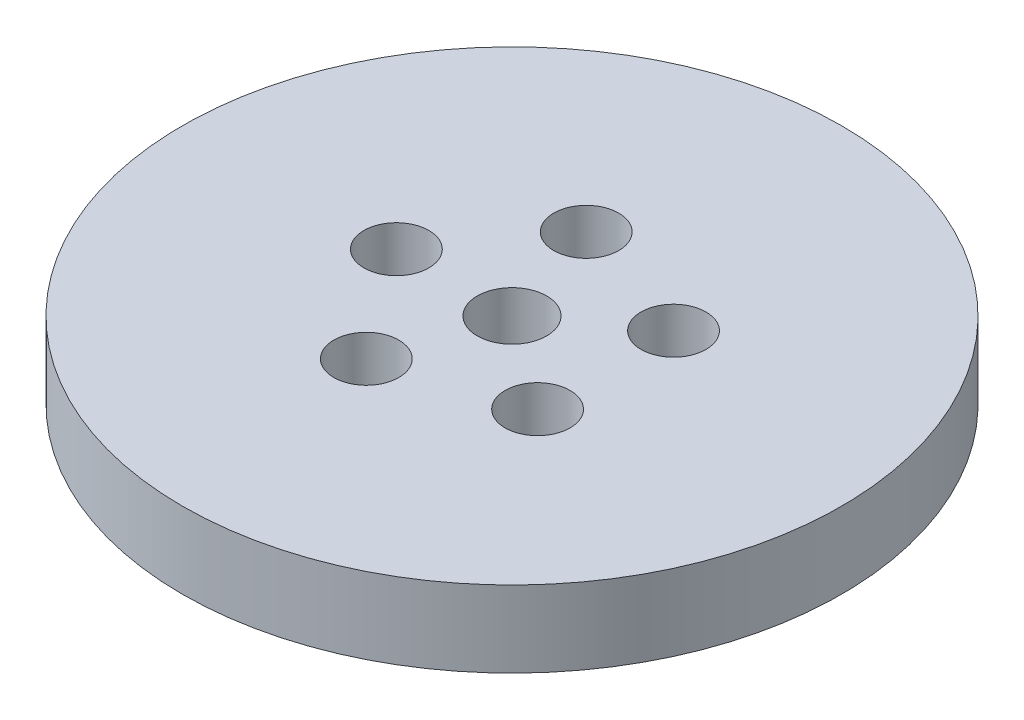
ISO-10303-21;
HEADER;
FILE_DESCRIPTION(('STEP AP214'),'2;1');
FILE_NAME('part.step','',(''),(''),'','','');
FILE_SCHEMA(('AUTOMOTIVE_DESIGN { 1 0 10303 214 1 1 1 1 }'));
ENDSEC;
DATA;
#1=APPLICATION_CONTEXT('core data for automotive mechanical design processes');
#2=APPLICATION_PROTOCOL_DEFINITION('international standard','automotive_design',2000,#1);
#3=PRODUCT_CONTEXT('',#1,'mechanical');
#4=PRODUCT('Part','Part','',(#3));
#5=PRODUCT_RELATED_PRODUCT_CATEGORY('part','',(#4));
#6=PRODUCT_DEFINITION_FORMATION('','',#4);
#7=PRODUCT_DEFINITION_CONTEXT('part definition',#1,'design');
#8=PRODUCT_DEFINITION('design','',#6,#7);
#9=PRODUCT_DEFINITION_SHAPE('','',#8);
#10=(LENGTH_UNIT() NAMED_UNIT(*) SI_UNIT(.MILLI.,.METRE.));
#11=(NAMED_UNIT(*) PLANE_ANGLE_UNIT() SI_UNIT($,.RADIAN.));
#12=(NAMED_UNIT(*) SI_UNIT($,.STERADIAN.) SOLID_ANGLE_UNIT());
#13=UNCERTAINTY_MEASURE_WITH_UNIT(LENGTH_MEASURE(1.E-05),#10,'distance_accuracy_value','');
#14=(GEOMETRIC_REPRESENTATION_CONTEXT(3) GLOBAL_UNCERTAINTY_ASSIGNED_CONTEXT((#13)) GLOBAL_UNIT_ASSIGNED_CONTEXT((#10,
#11,#12)) REPRESENTATION_CONTEXT('',''));
#15=CARTESIAN_POINT('',(0.,0.,0.));
#16=DIRECTION('',(0.,0.,1.));
#17=DIRECTION('',(1.,0.,0.));
#18=AXIS2_PLACEMENT_3D('',#15,#16,#17);
#19=CARTESIAN_POINT('',(0.,22.,0.));
#20=DIRECTION('',(0.,-1.,0.));
#21=DIRECTION('',(0.,0.,-1.));
#22=AXIS2_PLACEMENT_3D('',#19,#20,#21);
#23=CYLINDRICAL_SURFACE('',#22,95.);
#24=CARTESIAN_POINT('',(0.,22.,0.));
#25=DIRECTION('',(0.,1.,0.));
#26=DIRECTION('',(0.,0.,1.));
#27=AXIS2_PLACEMENT_3D('',#24,#25,#26);
#28=CIRCLE('',#27,95.);
#29=CARTESIAN_POINT('',(0.,22.,95.));
#30=VERTEX_POINT('',#29);
#31=EDGE_CURVE('E10',#30,#30,#28,.T.);
#32=ORIENTED_EDGE('',*,*,#31,.F.);
#33=EDGE_LOOP('',(#32));
#34=FACE_BOUND('',#33,.T.);
#35=CARTESIAN_POINT('',(0.,0.,0.));
#36=DIRECTION('',(0.,1.,0.));
#37=DIRECTION('',(0.,0.,1.));
#38=AXIS2_PLACEMENT_3D('',#35,#36,#37);
#39=CIRCLE('',#38,95.);
#40=CARTESIAN_POINT('',(0.,0.,95.));
#41=VERTEX_POINT('',#40);
#42=EDGE_CURVE('E37',#41,#41,#39,.T.);
#43=ORIENTED_EDGE('',*,*,#42,.T.);
#44=EDGE_LOOP('',(#43));
#45=FACE_BOUND('',#44,.T.);
#46=ADVANCED_FACE('F40',(#34,#45),#23,.T.);
#47=CARTESIAN_POINT('',(0.,22.,0.));
#48=DIRECTION('',(0.,1.,0.));
#49=DIRECTION('',(0.,0.,1.));
#50=AXIS2_PLACEMENT_3D('',#47,#48,#49);
#51=PLANE('',#50);
#52=CARTESIAN_POINT('',(-10.2989671180846,22.,-31.6969615492369));
#53=DIRECTION('',(0.,1.,0.));
#54=DIRECTION('',(-0.95105651629515,0.,0.309016994374958));
#55=AXIS2_PLACEMENT_3D('',#52,#53,#54);
#56=CIRCLE('',#55,9.36474165704194);
#57=CARTESIAN_POINT('',(-19.205365694435,22.,-28.8030972292799));
#58=VERTEX_POINT('',#57);
#59=EDGE_CURVE('E70',#58,#58,#56,.T.);
#60=ORIENTED_EDGE('',*,*,#59,.F.);
#61=EDGE_LOOP('',(#60));
#62=FACE_BOUND('',#61,.T.);
#63=CARTESIAN_POINT('',(26.9630459641618,22.,-19.5897995775273));
#64=DIRECTION('',(0.,1.,0.));
#65=DIRECTION('',(-0.58778525229248,0.,-0.809016994374942));
#66=AXIS2_PLACEMENT_3D('',#63,#64,#65);
#67=CIRCLE('',#66,9.36474165704194);
#68=CARTESIAN_POINT('',(21.4585889266235,22.,-27.1660347260051));
#69=VERTEX_POINT('',#68);
#70=EDGE_CURVE('E71',#69,#69,#67,.T.);
#71=ORIENTED_EDGE('',*,*,#70,.F.);
#72=EDGE_LOOP('',(#71));
#73=FACE_BOUND('',#72,.T.);
#74=CARTESIAN_POINT('',(26.9630459641621,22.,19.5897995775269));
#75=DIRECTION('',(0.,1.,0.));
#76=DIRECTION('',(0.587785252292469,0.,-0.809016994374951));
#77=AXIS2_PLACEMENT_3D('',#74,#75,#76);
#78=CIRCLE('',#77,9.36474165704194);
#79=CARTESIAN_POINT('',(32.4675030017003,22.,12.0135644290489));
#80=VERTEX_POINT('',#79);
#81=EDGE_CURVE('E78',#80,#80,#78,.T.);
#82=ORIENTED_EDGE('',*,*,#81,.F.);
#83=EDGE_LOOP('',(#82));
#84=FACE_BOUND('',#83,.T.);
#85=CARTESIAN_POINT('',(-10.2989671180841,22.,31.6969615492371));
#86=DIRECTION('',(0.,1.,0.));
#87=DIRECTION('',(0.951056516295155,0.,0.309016994374945));
#88=AXIS2_PLACEMENT_3D('',#85,#86,#87);
#89=CIRCLE('',#88,9.36474165704194);
#90=CARTESIAN_POINT('',(-1.3925685417337,22.,34.590825869194));
#91=VERTEX_POINT('',#90);
#92=EDGE_CURVE('E61',#91,#91,#89,.T.);
#93=ORIENTED_EDGE('',*,*,#92,.F.);
#94=EDGE_LOOP('',(#93));
#95=FACE_BOUND('',#94,.T.);
#96=CARTESIAN_POINT('',(-33.3281576921556,22.,0.));
#97=DIRECTION('',(0.,1.,0.));
#98=DIRECTION('',(0.,0.,1.));
#99=AXIS2_PLACEMENT_3D('',#96,#97,#98);
#100=CIRCLE('',#99,9.36474165704194);
#101=CARTESIAN_POINT('',(-33.3281576921556,22.,9.36474165704194));
#102=VERTEX_POINT('',#101);
#103=EDGE_CURVE('E54',#102,#102,#100,.T.);
#104=ORIENTED_EDGE('',*,*,#103,.F.);
#105=EDGE_LOOP('',(#104));
#106=FACE_BOUND('',#105,.T.);
#107=CARTESIAN_POINT('',(0.,22.,0.));
#108=DIRECTION('',(0.,1.,0.));
#109=DIRECTION('',(0.,0.,1.));
#110=AXIS2_PLACEMENT_3D('',#107,#108,#109);
#111=CIRCLE('',#110,10.);
#112=CARTESIAN_POINT('',(0.,22.,10.));
#113=VERTEX_POINT('',#112);
#114=EDGE_CURVE('E50',#113,#113,#111,.T.);
#115=ORIENTED_EDGE('',*,*,#114,.F.);
#116=EDGE_LOOP('',(#115));
#117=FACE_BOUND('',#116,.T.);
#118=ORIENTED_EDGE('',*,*,#31,.T.);
#119=EDGE_LOOP('',(#118));
#120=FACE_BOUND('',#119,.T.);
#121=ADVANCED_FACE('F94',(#62,#73,#84,#95,#106,#117,#120),#51,.T.);
#122=CARTESIAN_POINT('',(0.,0.,0.));
#123=DIRECTION('',(0.,1.,0.));
#124=DIRECTION('',(0.,0.,1.));
#125=AXIS2_PLACEMENT_3D('',#122,#123,#124);
#126=PLANE('',#125);
#127=CARTESIAN_POINT('',(0.,0.,0.));
#128=DIRECTION('',(0.,1.,0.));
#129=DIRECTION('',(0.,0.,1.));
#130=AXIS2_PLACEMENT_3D('',#127,#128,#129);
#131=CIRCLE('',#130,10.);
#132=CARTESIAN_POINT('',(0.,0.,10.));
#133=VERTEX_POINT('',#132);
#134=EDGE_CURVE('E47',#133,#133,#131,.T.);
#135=ORIENTED_EDGE('',*,*,#134,.T.);
#136=EDGE_LOOP('',(#135));
#137=FACE_BOUND('',#136,.T.);
#138=ORIENTED_EDGE('',*,*,#42,.F.);
#139=EDGE_LOOP('',(#138));
#140=FACE_BOUND('',#139,.T.);
#141=ADVANCED_FACE('F100',(#137,#140),#126,.F.);
#142=CARTESIAN_POINT('',(0.,22.,0.));
#143=DIRECTION('',(0.,-1.,0.));
#144=DIRECTION('',(0.,0.,-1.));
#145=AXIS2_PLACEMENT_3D('',#142,#143,#144);
#146=CYLINDRICAL_SURFACE('',#145,10.);
#147=ORIENTED_EDGE('',*,*,#114,.T.);
#148=EDGE_LOOP('',(#147));
#149=FACE_BOUND('',#148,.T.);
#150=ORIENTED_EDGE('',*,*,#134,.F.);
#151=EDGE_LOOP('',(#150));
#152=FACE_BOUND('',#151,.T.);
#153=ADVANCED_FACE('F106',(#149,#152),#146,.F.);
#154=CARTESIAN_POINT('',(-33.3281576921556,5.84211507325759,0.));
#155=DIRECTION('',(0.,1.,0.));
#156=DIRECTION('',(0.,0.,1.));
#157=AXIS2_PLACEMENT_3D('',#154,#155,#156);
#158=CYLINDRICAL_SURFACE('',#157,9.36474165704194);
#159=CARTESIAN_POINT('',(-33.3281576921556,5.84211507325759,0.));
#160=DIRECTION('',(0.,1.,0.));
#161=DIRECTION('',(0.,0.,1.));
#162=AXIS2_PLACEMENT_3D('',#159,#160,#161);
#163=CIRCLE('',#162,9.36474165704194);
#164=CARTESIAN_POINT('',(-33.3281576921556,5.84211507325759,9.36474165704194));
#165=VERTEX_POINT('',#164);
#166=EDGE_CURVE('E55',#165,#165,#163,.T.);
#167=ORIENTED_EDGE('',*,*,#166,.F.);
#168=EDGE_LOOP('',(#167));
#169=FACE_BOUND('',#168,.T.);
#170=ORIENTED_EDGE('',*,*,#103,.T.);
#171=EDGE_LOOP('',(#170));
#172=FACE_BOUND('',#171,.T.);
#173=ADVANCED_FACE('F108',(#169,#172),#158,.F.);
#174=CARTESIAN_POINT('',(-33.3281576921556,5.84211507325759,0.));
#175=DIRECTION('',(0.,1.,0.));
#176=DIRECTION('',(0.,0.,1.));
#177=AXIS2_PLACEMENT_3D('',#174,#175,#176);
#178=PLANE('',#177);
#179=ORIENTED_EDGE('',*,*,#166,.T.);
#180=EDGE_LOOP('',(#179));
#181=FACE_BOUND('',#180,.T.);
#182=ADVANCED_FACE('F138',(#181),#178,.T.);
#183=CARTESIAN_POINT('',(-10.2989671180841,5.84211507325759,31.6969615492371));
#184=DIRECTION('',(0.,1.,0.));
#185=DIRECTION('',(0.,0.,1.));
#186=AXIS2_PLACEMENT_3D('',#183,#184,#185);
#187=CYLINDRICAL_SURFACE('',#186,9.36474165704194);
#188=CARTESIAN_POINT('',(-10.2989671180841,5.84211507325759,31.6969615492371));
#189=DIRECTION('',(0.,1.,0.));
#190=DIRECTION('',(0.951056516295155,0.,0.309016994374945));
#191=AXIS2_PLACEMENT_3D('',#188,#189,#190);
#192=CIRCLE('',#191,9.36474165704194);
#193=CARTESIAN_POINT('',(-1.3925685417337,5.84211507325759,34.590825869194));
#194=VERTEX_POINT('',#193);
#195=EDGE_CURVE('E59',#194,#194,#192,.T.);
#196=ORIENTED_EDGE('',*,*,#195,.F.);
#197=EDGE_LOOP('',(#196));
#198=FACE_BOUND('',#197,.T.);
#199=ORIENTED_EDGE('',*,*,#92,.T.);
#200=EDGE_LOOP('',(#199));
#201=FACE_BOUND('',#200,.T.);
#202=ADVANCED_FACE('F150',(#198,#201),#187,.F.);
#203=CARTESIAN_POINT('',(-10.2989671180841,5.84211507325759,31.6969615492371));
#204=DIRECTION('',(0.,1.,0.));
#205=DIRECTION('',(0.951056516295155,0.,0.309016994374945));
#206=AXIS2_PLACEMENT_3D('',#203,#204,#205);
#207=PLANE('',#206);
#208=ORIENTED_EDGE('',*,*,#195,.T.);
#209=EDGE_LOOP('',(#208));
#210=FACE_BOUND('',#209,.T.);
#211=ADVANCED_FACE('F89',(#210),#207,.T.);
#212=CARTESIAN_POINT('',(26.9630459641621,5.84211507325759,19.5897995775269));
#213=DIRECTION('',(0.,1.,0.));
#214=DIRECTION('',(0.,0.,1.));
#215=AXIS2_PLACEMENT_3D('',#212,#213,#214);
#216=CYLINDRICAL_SURFACE('',#215,9.36474165704194);
#217=CARTESIAN_POINT('',(26.9630459641621,5.84211507325759,19.5897995775269));
#218=DIRECTION('',(0.,1.,0.));
#219=DIRECTION('',(0.587785252292469,0.,-0.809016994374951));
#220=AXIS2_PLACEMENT_3D('',#217,#218,#219);
#221=CIRCLE('',#220,9.36474165704194);
#222=CARTESIAN_POINT('',(32.4675030017003,5.84211507325759,12.0135644290489));
#223=VERTEX_POINT('',#222);
#224=EDGE_CURVE('E63',#223,#223,#221,.T.);
#225=ORIENTED_EDGE('',*,*,#224,.F.);
#226=EDGE_LOOP('',(#225));
#227=FACE_BOUND('',#226,.T.);
#228=ORIENTED_EDGE('',*,*,#81,.T.);
#229=EDGE_LOOP('',(#228));
#230=FACE_BOUND('',#229,.T.);
#231=ADVANCED_FACE('F87',(#227,#230),#216,.F.);
#232=CARTESIAN_POINT('',(26.9630459641621,5.84211507325759,19.5897995775269));
#233=DIRECTION('',(0.,1.,0.));
#234=DIRECTION('',(0.587785252292469,0.,-0.809016994374951));
#235=AXIS2_PLACEMENT_3D('',#232,#233,#234);
#236=PLANE('',#235);
#237=ORIENTED_EDGE('',*,*,#224,.T.);
#238=EDGE_LOOP('',(#237));
#239=FACE_BOUND('',#238,.T.);
#240=ADVANCED_FACE('F84',(#239),#236,.T.);
#241=CARTESIAN_POINT('',(26.9630459641618,5.84211507325759,-19.5897995775273));
#242=DIRECTION('',(0.,1.,0.));
#243=DIRECTION('',(0.,0.,1.));
#244=AXIS2_PLACEMENT_3D('',#241,#242,#243);
#245=CYLINDRICAL_SURFACE('',#244,9.36474165704194);
#246=CARTESIAN_POINT('',(26.9630459641618,5.84211507325759,-19.5897995775273));
#247=DIRECTION('',(0.,1.,0.));
#248=DIRECTION('',(-0.58778525229248,0.,-0.809016994374942));
#249=AXIS2_PLACEMENT_3D('',#246,#247,#248);
#250=CIRCLE('',#249,9.36474165704194);
#251=CARTESIAN_POINT('',(21.4585889266235,5.84211507325759,-27.1660347260051));
#252=VERTEX_POINT('',#251);
#253=EDGE_CURVE('E76',#252,#252,#250,.T.);
#254=ORIENTED_EDGE('',*,*,#253,.F.);
#255=EDGE_LOOP('',(#254));
#256=FACE_BOUND('',#255,.T.);
#257=ORIENTED_EDGE('',*,*,#70,.T.);
#258=EDGE_LOOP('',(#257));
#259=FACE_BOUND('',#258,.T.);
#260=ADVANCED_FACE('F185',(#256,#259),#245,.F.);
#261=CARTESIAN_POINT('',(26.9630459641618,5.84211507325759,-19.5897995775273));
#262=DIRECTION('',(0.,1.,0.));
#263=DIRECTION('',(-0.58778525229248,0.,-0.809016994374942));
#264=AXIS2_PLACEMENT_3D('',#261,#262,#263);
#265=PLANE('',#264);
#266=ORIENTED_EDGE('',*,*,#253,.T.);
#267=EDGE_LOOP('',(#266));
#268=FACE_BOUND('',#267,.T.);
#269=ADVANCED_FACE('F189',(#268),#265,.T.);
#270=CARTESIAN_POINT('',(-10.2989671180846,5.84211507325759,-31.6969615492369));
#271=DIRECTION('',(0.,1.,0.));
#272=DIRECTION('',(0.,0.,1.));
#273=AXIS2_PLACEMENT_3D('',#270,#271,#272);
#274=CYLINDRICAL_SURFACE('',#273,9.36474165704194);
#275=CARTESIAN_POINT('',(-10.2989671180846,5.84211507325759,-31.6969615492369));
#276=DIRECTION('',(0.,1.,0.));
#277=DIRECTION('',(-0.95105651629515,0.,0.309016994374958));
#278=AXIS2_PLACEMENT_3D('',#275,#276,#277);
#279=CIRCLE('',#278,9.36474165704194);
#280=CARTESIAN_POINT('',(-19.205365694435,5.84211507325759,-28.8030972292799));
#281=VERTEX_POINT('',#280);
#282=EDGE_CURVE('E69',#281,#281,#279,.T.);
#283=ORIENTED_EDGE('',*,*,#282,.F.);
#284=EDGE_LOOP('',(#283));
#285=FACE_BOUND('',#284,.T.);
#286=ORIENTED_EDGE('',*,*,#59,.T.);
#287=EDGE_LOOP('',(#286));
#288=FACE_BOUND('',#287,.T.);
#289=ADVANCED_FACE('F200',(#285,#288),#274,.F.);
#290=CARTESIAN_POINT('',(-10.2989671180846,5.84211507325759,-31.6969615492369));
#291=DIRECTION('',(0.,1.,0.));
#292=DIRECTION('',(-0.95105651629515,0.,0.309016994374958));
#293=AXIS2_PLACEMENT_3D('',#290,#291,#292);
#294=PLANE('',#293);
#295=ORIENTED_EDGE('',*,*,#282,.T.);
#296=EDGE_LOOP('',(#295));
#297=FACE_BOUND('',#296,.T.);
#298=ADVANCED_FACE('F208',(#297),#294,.T.);
#299=CLOSED_SHELL('',(#46,#121,#141,#153,#173,#182,#202,#211,#231,#240,#260,#269,#289,#298));
#300=MANIFOLD_SOLID_BREP('B2',#299);
#301=ADVANCED_BREP_SHAPE_REPRESENTATION('',(#18,#300),#14);
#302=SHAPE_DEFINITION_REPRESENTATION(#9,#301);
ENDSEC;
END-ISO-10303-21;
